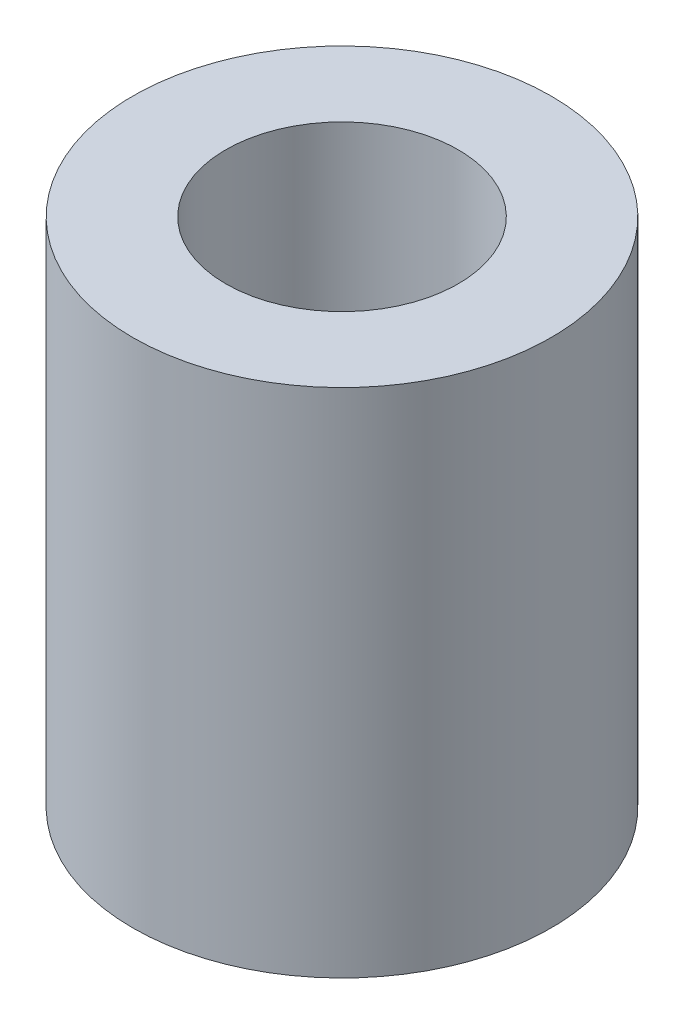
ISO-10303-21;
HEADER;
FILE_DESCRIPTION(('STEP AP214'),'2;1');
FILE_NAME('part.step','',(''),(''),'','','');
FILE_SCHEMA(('AUTOMOTIVE_DESIGN { 1 0 10303 214 1 1 1 1 }'));
ENDSEC;
DATA;
#1=APPLICATION_CONTEXT('core data for automotive mechanical design processes');
#2=APPLICATION_PROTOCOL_DEFINITION('international standard','automotive_design',2000,#1);
#3=PRODUCT_CONTEXT('',#1,'mechanical');
#4=PRODUCT('Part','Part','',(#3));
#5=PRODUCT_RELATED_PRODUCT_CATEGORY('part','',(#4));
#6=PRODUCT_DEFINITION_FORMATION('','',#4);
#7=PRODUCT_DEFINITION_CONTEXT('part definition',#1,'design');
#8=PRODUCT_DEFINITION('design','',#6,#7);
#9=PRODUCT_DEFINITION_SHAPE('','',#8);
#10=(LENGTH_UNIT() NAMED_UNIT(*) SI_UNIT(.MILLI.,.METRE.));
#11=(NAMED_UNIT(*) PLANE_ANGLE_UNIT() SI_UNIT($,.RADIAN.));
#12=(NAMED_UNIT(*) SI_UNIT($,.STERADIAN.) SOLID_ANGLE_UNIT());
#13=UNCERTAINTY_MEASURE_WITH_UNIT(LENGTH_MEASURE(1.E-05),#10,'distance_accuracy_value','');
#14=(GEOMETRIC_REPRESENTATION_CONTEXT(3) GLOBAL_UNCERTAINTY_ASSIGNED_CONTEXT((#13)) GLOBAL_UNIT_ASSIGNED_CONTEXT((#10,
#11,#12)) REPRESENTATION_CONTEXT('',''));
#15=CARTESIAN_POINT('',(0.,0.,0.));
#16=DIRECTION('',(0.,0.,1.));
#17=DIRECTION('',(1.,0.,0.));
#18=AXIS2_PLACEMENT_3D('',#15,#16,#17);
#19=CARTESIAN_POINT('',(0.,6.6,0.));
#20=DIRECTION('',(0.,1.,0.));
#21=DIRECTION('',(0.,0.,1.));
#22=AXIS2_PLACEMENT_3D('',#19,#20,#21);
#23=PLANE('',#22);
#24=CARTESIAN_POINT('',(0.,6.6,0.));
#25=DIRECTION('',(0.,1.,0.));
#26=DIRECTION('',(0.,0.,1.));
#27=AXIS2_PLACEMENT_3D('',#24,#25,#26);
#28=CIRCLE('',#27,2.7);
#29=CARTESIAN_POINT('',(0.,6.6,2.7));
#30=VERTEX_POINT('',#29);
#31=EDGE_CURVE('E10',#30,#30,#28,.T.);
#32=ORIENTED_EDGE('',*,*,#31,.T.);
#33=EDGE_LOOP('',(#32));
#34=FACE_BOUND('',#33,.T.);
#35=CARTESIAN_POINT('',(0.,6.6,0.));
#36=DIRECTION('',(0.,1.,0.));
#37=DIRECTION('',(0.,0.,1.));
#38=AXIS2_PLACEMENT_3D('',#35,#36,#37);
#39=CIRCLE('',#38,1.5);
#40=CARTESIAN_POINT('',(0.,6.6,1.5));
#41=VERTEX_POINT('',#40);
#42=EDGE_CURVE('E42',#41,#41,#39,.T.);
#43=ORIENTED_EDGE('',*,*,#42,.F.);
#44=EDGE_LOOP('',(#43));
#45=FACE_BOUND('',#44,.T.);
#46=ADVANCED_FACE('F31',(#34,#45),#23,.T.);
#47=CARTESIAN_POINT('',(0.,0.,0.));
#48=DIRECTION('',(0.,1.,0.));
#49=DIRECTION('',(0.,0.,1.));
#50=AXIS2_PLACEMENT_3D('',#47,#48,#49);
#51=PLANE('',#50);
#52=CARTESIAN_POINT('',(0.,0.,0.));
#53=DIRECTION('',(0.,1.,0.));
#54=DIRECTION('',(0.,0.,1.));
#55=AXIS2_PLACEMENT_3D('',#52,#53,#54);
#56=CIRCLE('',#55,2.7);
#57=CARTESIAN_POINT('',(0.,0.,2.7));
#58=VERTEX_POINT('',#57);
#59=EDGE_CURVE('E35',#58,#58,#56,.T.);
#60=ORIENTED_EDGE('',*,*,#59,.F.);
#61=EDGE_LOOP('',(#60));
#62=FACE_BOUND('',#61,.T.);
#63=CARTESIAN_POINT('',(0.,0.,0.));
#64=DIRECTION('',(0.,1.,0.));
#65=DIRECTION('',(0.,0.,1.));
#66=AXIS2_PLACEMENT_3D('',#63,#64,#65);
#67=CIRCLE('',#66,1.5);
#68=CARTESIAN_POINT('',(0.,0.,1.5));
#69=VERTEX_POINT('',#68);
#70=EDGE_CURVE('E44',#69,#69,#67,.T.);
#71=ORIENTED_EDGE('',*,*,#70,.T.);
#72=EDGE_LOOP('',(#71));
#73=FACE_BOUND('',#72,.T.);
#74=ADVANCED_FACE('F54',(#62,#73),#51,.F.);
#75=CARTESIAN_POINT('',(0.,6.6,0.));
#76=DIRECTION('',(0.,-1.,0.));
#77=DIRECTION('',(0.,0.,-1.));
#78=AXIS2_PLACEMENT_3D('',#75,#76,#77);
#79=CYLINDRICAL_SURFACE('',#78,2.7);
#80=ORIENTED_EDGE('',*,*,#31,.F.);
#81=EDGE_LOOP('',(#80));
#82=FACE_BOUND('',#81,.T.);
#83=ORIENTED_EDGE('',*,*,#59,.T.);
#84=EDGE_LOOP('',(#83));
#85=FACE_BOUND('',#84,.T.);
#86=ADVANCED_FACE('F33',(#82,#85),#79,.T.);
#87=CARTESIAN_POINT('',(0.,6.6,0.));
#88=DIRECTION('',(0.,-1.,0.));
#89=DIRECTION('',(0.,0.,-1.));
#90=AXIS2_PLACEMENT_3D('',#87,#88,#89);
#91=CYLINDRICAL_SURFACE('',#90,1.5);
#92=ORIENTED_EDGE('',*,*,#42,.T.);
#93=EDGE_LOOP('',(#92));
#94=FACE_BOUND('',#93,.T.);
#95=ORIENTED_EDGE('',*,*,#70,.F.);
#96=EDGE_LOOP('',(#95));
#97=FACE_BOUND('',#96,.T.);
#98=ADVANCED_FACE('F50',(#94,#97),#91,.F.);
#99=CLOSED_SHELL('',(#46,#74,#86,#98));
#100=MANIFOLD_SOLID_BREP('B2',#99);
#101=ADVANCED_BREP_SHAPE_REPRESENTATION('',(#18,#100),#14);
#102=SHAPE_DEFINITION_REPRESENTATION(#9,#101);
ENDSEC;
END-ISO-10303-21;
